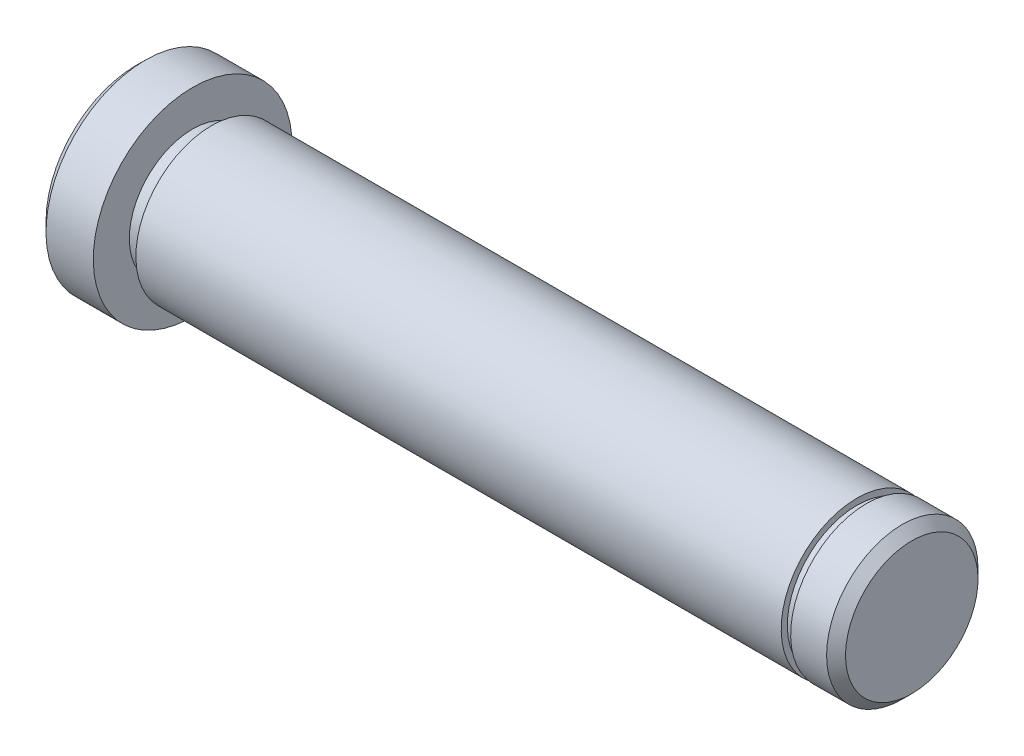
ISO-10303-21;
HEADER;
FILE_DESCRIPTION(('STEP AP214'),'2;1');
FILE_NAME('part.step','',(''),(''),'','','');
FILE_SCHEMA(('AUTOMOTIVE_DESIGN { 1 0 10303 214 1 1 1 1 }'));
ENDSEC;
DATA;
#1=APPLICATION_CONTEXT('core data for automotive mechanical design processes');
#2=APPLICATION_PROTOCOL_DEFINITION('international standard','automotive_design',2000,#1);
#3=PRODUCT_CONTEXT('',#1,'mechanical');
#4=PRODUCT('Part','Part','',(#3));
#5=PRODUCT_RELATED_PRODUCT_CATEGORY('part','',(#4));
#6=PRODUCT_DEFINITION_FORMATION('','',#4);
#7=PRODUCT_DEFINITION_CONTEXT('part definition',#1,'design');
#8=PRODUCT_DEFINITION('design','',#6,#7);
#9=PRODUCT_DEFINITION_SHAPE('','',#8);
#10=(LENGTH_UNIT() NAMED_UNIT(*) SI_UNIT(.MILLI.,.METRE.));
#11=(NAMED_UNIT(*) PLANE_ANGLE_UNIT() SI_UNIT($,.RADIAN.));
#12=(NAMED_UNIT(*) SI_UNIT($,.STERADIAN.) SOLID_ANGLE_UNIT());
#13=UNCERTAINTY_MEASURE_WITH_UNIT(LENGTH_MEASURE(1.E-05),#10,'distance_accuracy_value','');
#14=(GEOMETRIC_REPRESENTATION_CONTEXT(3) GLOBAL_UNCERTAINTY_ASSIGNED_CONTEXT((#13)) GLOBAL_UNIT_ASSIGNED_CONTEXT((#10,
#11,#12)) REPRESENTATION_CONTEXT('',''));
#15=CARTESIAN_POINT('',(0.,0.,0.));
#16=DIRECTION('',(0.,0.,1.));
#17=DIRECTION('',(1.,0.,0.));
#18=AXIS2_PLACEMENT_3D('',#15,#16,#17);
#19=CARTESIAN_POINT('',(77.2,0.,0.));
#20=DIRECTION('',(1.,0.,0.));
#21=DIRECTION('',(0.,1.,0.));
#22=AXIS2_PLACEMENT_3D('',#19,#20,#21);
#23=PLANE('',#22);
#24=CARTESIAN_POINT('',(77.2,0.,0.));
#25=DIRECTION('',(1.,0.,0.));
#26=DIRECTION('',(0.,1.,0.));
#27=AXIS2_PLACEMENT_3D('',#24,#25,#26);
#28=CIRCLE('',#27,8.);
#29=CARTESIAN_POINT('',(77.2,8.,0.));
#30=VERTEX_POINT('',#29);
#31=EDGE_CURVE('E79',#30,#30,#28,.T.);
#32=ORIENTED_EDGE('',*,*,#31,.F.);
#33=EDGE_LOOP('',(#32));
#34=FACE_BOUND('',#33,.T.);
#35=CARTESIAN_POINT('',(77.2,0.,0.));
#36=DIRECTION('',(1.,0.,0.));
#37=DIRECTION('',(0.,1.,0.));
#38=AXIS2_PLACEMENT_3D('',#35,#36,#37);
#39=CIRCLE('',#38,7.35);
#40=CARTESIAN_POINT('',(77.2,7.35,0.));
#41=VERTEX_POINT('',#40);
#42=EDGE_CURVE('E58',#41,#41,#39,.T.);
#43=ORIENTED_EDGE('',*,*,#42,.T.);
#44=EDGE_LOOP('',(#43));
#45=FACE_BOUND('',#44,.T.);
#46=ADVANCED_FACE('F37',(#34,#45),#23,.F.);
#47=CARTESIAN_POINT('',(82.,0.,0.));
#48=DIRECTION('',(1.,0.,0.));
#49=DIRECTION('',(0.,1.,0.));
#50=AXIS2_PLACEMENT_3D('',#47,#48,#49);
#51=CYLINDRICAL_SURFACE('',#50,7.35);
#52=ORIENTED_EDGE('',*,*,#42,.F.);
#53=EDGE_LOOP('',(#52));
#54=FACE_BOUND('',#53,.T.);
#55=CARTESIAN_POINT('',(76.2,0.,0.));
#56=DIRECTION('',(1.,0.,0.));
#57=DIRECTION('',(0.,1.,0.));
#58=AXIS2_PLACEMENT_3D('',#55,#56,#57);
#59=CIRCLE('',#58,7.35);
#60=CARTESIAN_POINT('',(76.2,7.35,0.));
#61=VERTEX_POINT('',#60);
#62=EDGE_CURVE('E61',#61,#61,#59,.T.);
#63=ORIENTED_EDGE('',*,*,#62,.T.);
#64=EDGE_LOOP('',(#63));
#65=FACE_BOUND('',#64,.T.);
#66=ADVANCED_FACE('F87',(#54,#65),#51,.T.);
#67=CARTESIAN_POINT('',(76.2,0.,0.));
#68=DIRECTION('',(-1.,0.,0.));
#69=DIRECTION('',(0.,-1.,0.));
#70=AXIS2_PLACEMENT_3D('',#67,#68,#69);
#71=PLANE('',#70);
#72=ORIENTED_EDGE('',*,*,#62,.F.);
#73=EDGE_LOOP('',(#72));
#74=FACE_BOUND('',#73,.T.);
#75=CARTESIAN_POINT('',(76.2,0.,0.));
#76=DIRECTION('',(1.,0.,0.));
#77=DIRECTION('',(0.,1.,0.));
#78=AXIS2_PLACEMENT_3D('',#75,#76,#77);
#79=CIRCLE('',#78,8.);
#80=CARTESIAN_POINT('',(76.2,8.,0.));
#81=VERTEX_POINT('',#80);
#82=EDGE_CURVE('E64',#81,#81,#79,.T.);
#83=ORIENTED_EDGE('',*,*,#82,.T.);
#84=EDGE_LOOP('',(#83));
#85=FACE_BOUND('',#84,.T.);
#86=ADVANCED_FACE('F93',(#74,#85),#71,.F.);
#87=CARTESIAN_POINT('',(82.,0.,0.));
#88=DIRECTION('',(1.,0.,0.));
#89=DIRECTION('',(0.,1.,0.));
#90=AXIS2_PLACEMENT_3D('',#87,#88,#89);
#91=CYLINDRICAL_SURFACE('',#90,8.);
#92=ORIENTED_EDGE('',*,*,#82,.F.);
#93=EDGE_LOOP('',(#92));
#94=FACE_BOUND('',#93,.T.);
#95=CARTESIAN_POINT('',(7.99999999999999,0.,0.));
#96=DIRECTION('',(1.,0.,0.));
#97=DIRECTION('',(0.,1.,0.));
#98=AXIS2_PLACEMENT_3D('',#95,#96,#97);
#99=CIRCLE('',#98,8.);
#100=CARTESIAN_POINT('',(7.99999999999999,8.,0.));
#101=VERTEX_POINT('',#100);
#102=EDGE_CURVE('E67',#101,#101,#99,.T.);
#103=ORIENTED_EDGE('',*,*,#102,.T.);
#104=EDGE_LOOP('',(#103));
#105=FACE_BOUND('',#104,.T.);
#106=ADVANCED_FACE('F99',(#94,#105),#91,.T.);
#107=CARTESIAN_POINT('',(8.,0.,0.));
#108=DIRECTION('',(1.,0.,0.));
#109=DIRECTION('',(0.,1.,0.));
#110=AXIS2_PLACEMENT_3D('',#107,#108,#109);
#111=PLANE('',#110);
#112=ORIENTED_EDGE('',*,*,#102,.F.);
#113=EDGE_LOOP('',(#112));
#114=FACE_BOUND('',#113,.T.);
#115=CARTESIAN_POINT('',(7.99999999999999,0.,0.));
#116=DIRECTION('',(1.,0.,0.));
#117=DIRECTION('',(0.,1.,0.));
#118=AXIS2_PLACEMENT_3D('',#115,#116,#117);
#119=CIRCLE('',#118,6.691876128);
#120=CARTESIAN_POINT('',(7.99999999999999,6.691876128,0.));
#121=VERTEX_POINT('',#120);
#122=EDGE_CURVE('E70',#121,#121,#119,.T.);
#123=ORIENTED_EDGE('',*,*,#122,.T.);
#124=EDGE_LOOP('',(#123));
#125=FACE_BOUND('',#124,.T.);
#126=ADVANCED_FACE('F105',(#114,#125),#111,.F.);
#127=CARTESIAN_POINT('',(82.,0.,0.));
#128=DIRECTION('',(1.,0.,0.));
#129=DIRECTION('',(0.,1.,0.));
#130=AXIS2_PLACEMENT_3D('',#127,#128,#129);
#131=CYLINDRICAL_SURFACE('',#130,6.691876128);
#132=ORIENTED_EDGE('',*,*,#122,.F.);
#133=EDGE_LOOP('',(#132));
#134=FACE_BOUND('',#133,.T.);
#135=CARTESIAN_POINT('',(6.00000000000001,0.,0.));
#136=DIRECTION('',(1.,0.,0.));
#137=DIRECTION('',(0.,1.,0.));
#138=AXIS2_PLACEMENT_3D('',#135,#136,#137);
#139=CIRCLE('',#138,6.691876128);
#140=CARTESIAN_POINT('',(6.00000000000001,6.691876128,0.));
#141=VERTEX_POINT('',#140);
#142=EDGE_CURVE('E73',#141,#141,#139,.T.);
#143=ORIENTED_EDGE('',*,*,#142,.T.);
#144=EDGE_LOOP('',(#143));
#145=FACE_BOUND('',#144,.T.);
#146=ADVANCED_FACE('F111',(#134,#145),#131,.T.);
#147=CARTESIAN_POINT('',(6.,0.,0.));
#148=DIRECTION('',(-1.,0.,0.));
#149=DIRECTION('',(0.,-1.,0.));
#150=AXIS2_PLACEMENT_3D('',#147,#148,#149);
#151=PLANE('',#150);
#152=ORIENTED_EDGE('',*,*,#142,.F.);
#153=EDGE_LOOP('',(#152));
#154=FACE_BOUND('',#153,.T.);
#155=CARTESIAN_POINT('',(6.00000000000001,0.,0.));
#156=DIRECTION('',(1.,0.,0.));
#157=DIRECTION('',(0.,1.,0.));
#158=AXIS2_PLACEMENT_3D('',#155,#156,#157);
#159=CIRCLE('',#158,10.5);
#160=CARTESIAN_POINT('',(6.00000000000001,10.5,0.));
#161=VERTEX_POINT('',#160);
#162=EDGE_CURVE('E76',#161,#161,#159,.T.);
#163=ORIENTED_EDGE('',*,*,#162,.T.);
#164=EDGE_LOOP('',(#163));
#165=FACE_BOUND('',#164,.T.);
#166=ADVANCED_FACE('F117',(#154,#165),#151,.F.);
#167=CARTESIAN_POINT('',(82.,0.,0.));
#168=DIRECTION('',(1.,0.,0.));
#169=DIRECTION('',(0.,1.,0.));
#170=AXIS2_PLACEMENT_3D('',#167,#168,#169);
#171=CYLINDRICAL_SURFACE('',#170,10.5);
#172=CARTESIAN_POINT('',(0.999999999999987,0.,0.));
#173=DIRECTION('',(1.,0.,0.));
#174=DIRECTION('',(0.,1.,0.));
#175=AXIS2_PLACEMENT_3D('',#172,#173,#174);
#176=CIRCLE('',#175,10.5);
#177=CARTESIAN_POINT('',(0.999999999999987,10.5,0.));
#178=VERTEX_POINT('',#177);
#179=EDGE_CURVE('E45',#178,#178,#176,.T.);
#180=ORIENTED_EDGE('',*,*,#179,.T.);
#181=EDGE_LOOP('',(#180));
#182=FACE_BOUND('',#181,.T.);
#183=ORIENTED_EDGE('',*,*,#162,.F.);
#184=EDGE_LOOP('',(#183));
#185=FACE_BOUND('',#184,.T.);
#186=ADVANCED_FACE('F123',(#182,#185),#171,.T.);
#187=CARTESIAN_POINT('',(0.,0.,0.));
#188=DIRECTION('',(1.,0.,0.));
#189=DIRECTION('',(0.,1.,0.));
#190=AXIS2_PLACEMENT_3D('',#187,#188,#189);
#191=PLANE('',#190);
#192=CARTESIAN_POINT('',(0.,0.,0.));
#193=DIRECTION('',(1.,0.,0.));
#194=DIRECTION('',(0.,1.,0.));
#195=AXIS2_PLACEMENT_3D('',#192,#193,#194);
#196=CIRCLE('',#195,9.5);
#197=CARTESIAN_POINT('',(0.,9.5,0.));
#198=VERTEX_POINT('',#197);
#199=EDGE_CURVE('E10',#198,#198,#196,.F.);
#200=ORIENTED_EDGE('',*,*,#199,.T.);
#201=EDGE_LOOP('',(#200));
#202=FACE_BOUND('',#201,.T.);
#203=ADVANCED_FACE('F128',(#202),#191,.F.);
#204=CARTESIAN_POINT('',(82.,0.,0.));
#205=DIRECTION('',(-1.,0.,0.));
#206=DIRECTION('',(0.,-1.,0.));
#207=AXIS2_PLACEMENT_3D('',#204,#205,#206);
#208=PLANE('',#207);
#209=CARTESIAN_POINT('',(82.,0.,0.));
#210=DIRECTION('',(-1.,0.,0.));
#211=DIRECTION('',(0.,-1.,0.));
#212=AXIS2_PLACEMENT_3D('',#209,#210,#211);
#213=CIRCLE('',#212,6.99999999999999);
#214=CARTESIAN_POINT('',(82.,-6.99999999999999,0.));
#215=VERTEX_POINT('',#214);
#216=EDGE_CURVE('E53',#215,#215,#213,.F.);
#217=ORIENTED_EDGE('',*,*,#216,.T.);
#218=EDGE_LOOP('',(#217));
#219=FACE_BOUND('',#218,.T.);
#220=ADVANCED_FACE('F133',(#219),#208,.F.);
#221=CARTESIAN_POINT('',(81.,0.,0.));
#222=DIRECTION('',(-1.,0.,0.));
#223=DIRECTION('',(0.,-1.,0.));
#224=AXIS2_PLACEMENT_3D('',#221,#222,#223);
#225=CIRCLE('',#224,8.);
#226=CARTESIAN_POINT('',(81.,-8.,0.));
#227=VERTEX_POINT('',#226);
#228=EDGE_CURVE('E49',#227,#227,#225,.T.);
#229=ORIENTED_EDGE('',*,*,#228,.T.);
#230=EDGE_LOOP('',(#229));
#231=FACE_BOUND('',#230,.T.);
#232=ORIENTED_EDGE('',*,*,#31,.T.);
#233=EDGE_LOOP('',(#232));
#234=FACE_BOUND('',#233,.T.);
#235=ADVANCED_FACE('F83',(#231,#234),#91,.T.);
#236=CARTESIAN_POINT('',(82.,0.,0.));
#237=DIRECTION('',(-1.,0.,0.));
#238=DIRECTION('',(0.,-1.,0.));
#239=AXIS2_PLACEMENT_3D('',#236,#237,#238);
#240=CONICAL_SURFACE('',#239,6.99999999999999,0.785398163397445);
#241=ORIENTED_EDGE('',*,*,#228,.F.);
#242=EDGE_LOOP('',(#241));
#243=FACE_BOUND('',#242,.T.);
#244=ORIENTED_EDGE('',*,*,#216,.F.);
#245=EDGE_LOOP('',(#244));
#246=FACE_BOUND('',#245,.T.);
#247=ADVANCED_FACE('F137',(#243,#246),#240,.T.);
#248=CARTESIAN_POINT('',(0.999999999999987,0.,0.));
#249=DIRECTION('',(1.,0.,0.));
#250=DIRECTION('',(0.,1.,0.));
#251=AXIS2_PLACEMENT_3D('',#248,#249,#250);
#252=CONICAL_SURFACE('',#251,10.5,0.785398163397454);
#253=ORIENTED_EDGE('',*,*,#199,.F.);
#254=EDGE_LOOP('',(#253));
#255=FACE_BOUND('',#254,.T.);
#256=ORIENTED_EDGE('',*,*,#179,.F.);
#257=EDGE_LOOP('',(#256));
#258=FACE_BOUND('',#257,.T.);
#259=ADVANCED_FACE('F40',(#255,#258),#252,.T.);
#260=CLOSED_SHELL('',(#46,#66,#86,#106,#126,#146,#166,#186,#203,#220,#235,#247,#259));
#261=MANIFOLD_SOLID_BREP('B2',#260);
#262=ADVANCED_BREP_SHAPE_REPRESENTATION('',(#18,#261),#14);
#263=SHAPE_DEFINITION_REPRESENTATION(#9,#262);
ENDSEC;
END-ISO-10303-21;
